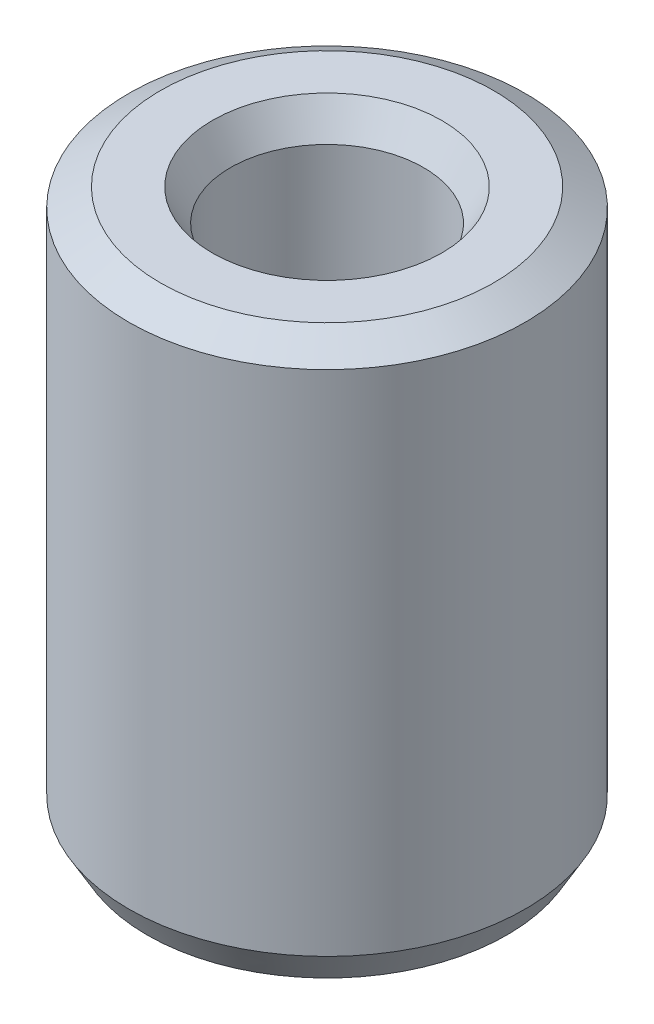
ISO-10303-21;
HEADER;
FILE_DESCRIPTION(('STEP AP214'),'2;1');
FILE_NAME('part.step','',(''),(''),'','','');
FILE_SCHEMA(('AUTOMOTIVE_DESIGN { 1 0 10303 214 1 1 1 1 }'));
ENDSEC;
DATA;
#1=APPLICATION_CONTEXT('core data for automotive mechanical design processes');
#2=APPLICATION_PROTOCOL_DEFINITION('international standard','automotive_design',2000,#1);
#3=PRODUCT_CONTEXT('',#1,'mechanical');
#4=PRODUCT('Part','Part','',(#3));
#5=PRODUCT_RELATED_PRODUCT_CATEGORY('part','',(#4));
#6=PRODUCT_DEFINITION_FORMATION('','',#4);
#7=PRODUCT_DEFINITION_CONTEXT('part definition',#1,'design');
#8=PRODUCT_DEFINITION('design','',#6,#7);
#9=PRODUCT_DEFINITION_SHAPE('','',#8);
#10=(LENGTH_UNIT() NAMED_UNIT(*) SI_UNIT(.MILLI.,.METRE.));
#11=(NAMED_UNIT(*) PLANE_ANGLE_UNIT() SI_UNIT($,.RADIAN.));
#12=(NAMED_UNIT(*) SI_UNIT($,.STERADIAN.) SOLID_ANGLE_UNIT());
#13=UNCERTAINTY_MEASURE_WITH_UNIT(LENGTH_MEASURE(1.E-05),#10,'distance_accuracy_value','');
#14=(GEOMETRIC_REPRESENTATION_CONTEXT(3) GLOBAL_UNCERTAINTY_ASSIGNED_CONTEXT((#13)) GLOBAL_UNIT_ASSIGNED_CONTEXT((#10,
#11,#12)) REPRESENTATION_CONTEXT('',''));
#15=CARTESIAN_POINT('',(0.,0.,0.));
#16=DIRECTION('',(0.,0.,1.));
#17=DIRECTION('',(1.,0.,0.));
#18=AXIS2_PLACEMENT_3D('',#15,#16,#17);
#19=CARTESIAN_POINT('',(0.,105.562151461287,0.));
#20=DIRECTION('',(0.,-1.,0.));
#21=DIRECTION('',(0.,0.,-1.));
#22=AXIS2_PLACEMENT_3D('',#19,#20,#21);
#23=CYLINDRICAL_SURFACE('',#22,37.5);
#24=CARTESIAN_POINT('',(0.,5.980593643517,0.));
#25=DIRECTION('',(0.,1.,0.));
#26=DIRECTION('',(0.,0.,1.));
#27=AXIS2_PLACEMENT_3D('',#24,#25,#26);
#28=CIRCLE('',#27,37.5);
#29=CARTESIAN_POINT('',(0.,5.980593643517,37.5));
#30=VERTEX_POINT('',#29);
#31=EDGE_CURVE('E10',#30,#30,#28,.T.);
#32=ORIENTED_EDGE('',*,*,#31,.T.);
#33=EDGE_LOOP('',(#32));
#34=FACE_BOUND('',#33,.T.);
#35=CARTESIAN_POINT('',(0.,102.109254111288,0.));
#36=DIRECTION('',(0.,1.,0.));
#37=DIRECTION('',(0.,0.,1.));
#38=AXIS2_PLACEMENT_3D('',#35,#36,#37);
#39=CIRCLE('',#38,37.5);
#40=CARTESIAN_POINT('',(0.,102.109254111288,37.5));
#41=VERTEX_POINT('',#40);
#42=EDGE_CURVE('E50',#41,#41,#39,.F.);
#43=ORIENTED_EDGE('',*,*,#42,.T.);
#44=EDGE_LOOP('',(#43));
#45=FACE_BOUND('',#44,.T.);
#46=ADVANCED_FACE('F39',(#34,#45),#23,.T.);
#47=CARTESIAN_POINT('',(0.,105.562151461287,0.));
#48=DIRECTION('',(0.,1.,0.));
#49=DIRECTION('',(0.,0.,1.));
#50=AXIS2_PLACEMENT_3D('',#47,#48,#49);
#51=PLANE('',#50);
#52=CARTESIAN_POINT('',(0.,105.562151461287,0.));
#53=DIRECTION('',(0.,1.,0.));
#54=DIRECTION('',(0.,0.,1.));
#55=AXIS2_PLACEMENT_3D('',#52,#53,#54);
#56=CIRCLE('',#55,21.7124673029602);
#57=CARTESIAN_POINT('',(0.,105.562151461287,21.7124673029602));
#58=VERTEX_POINT('',#57);
#59=EDGE_CURVE('E58',#58,#58,#56,.F.);
#60=ORIENTED_EDGE('',*,*,#59,.T.);
#61=EDGE_LOOP('',(#60));
#62=FACE_BOUND('',#61,.T.);
#63=CARTESIAN_POINT('',(0.,105.562151461287,0.));
#64=DIRECTION('',(0.,1.,0.));
#65=DIRECTION('',(0.,0.,1.));
#66=AXIS2_PLACEMENT_3D('',#63,#64,#65);
#67=CIRCLE('',#66,31.5194063564831);
#68=CARTESIAN_POINT('',(0.,105.562151461287,31.5194063564831));
#69=VERTEX_POINT('',#68);
#70=EDGE_CURVE('E61',#69,#69,#67,.T.);
#71=ORIENTED_EDGE('',*,*,#70,.T.);
#72=EDGE_LOOP('',(#71));
#73=FACE_BOUND('',#72,.T.);
#74=ADVANCED_FACE('F88',(#62,#73),#51,.T.);
#75=CARTESIAN_POINT('',(0.,0.,0.));
#76=DIRECTION('',(0.,1.,0.));
#77=DIRECTION('',(0.,0.,1.));
#78=AXIS2_PLACEMENT_3D('',#75,#76,#77);
#79=PLANE('',#78);
#80=CARTESIAN_POINT('',(0.,0.,0.));
#81=DIRECTION('',(0.,1.,0.));
#82=DIRECTION('',(0.,0.,1.));
#83=AXIS2_PLACEMENT_3D('',#80,#81,#82);
#84=CIRCLE('',#83,24.2401635964789);
#85=CARTESIAN_POINT('',(0.,0.,24.2401635964789));
#86=VERTEX_POINT('',#85);
#87=EDGE_CURVE('E51',#86,#86,#84,.T.);
#88=ORIENTED_EDGE('',*,*,#87,.T.);
#89=EDGE_LOOP('',(#88));
#90=FACE_BOUND('',#89,.T.);
#91=CARTESIAN_POINT('',(0.,0.,0.));
#92=DIRECTION('',(0.,1.,0.));
#93=DIRECTION('',(0.,0.,1.));
#94=AXIS2_PLACEMENT_3D('',#91,#92,#93);
#95=CIRCLE('',#94,34.0471026500017);
#96=CARTESIAN_POINT('',(0.,0.,34.0471026500017));
#97=VERTEX_POINT('',#96);
#98=EDGE_CURVE('E54',#97,#97,#95,.F.);
#99=ORIENTED_EDGE('',*,*,#98,.T.);
#100=EDGE_LOOP('',(#99));
#101=FACE_BOUND('',#100,.T.);
#102=ADVANCED_FACE('F83',(#90,#101),#79,.F.);
#103=CARTESIAN_POINT('',(0.,105.562151461287,0.));
#104=DIRECTION('',(0.,-1.,0.));
#105=DIRECTION('',(0.,0.,-1.));
#106=AXIS2_PLACEMENT_3D('',#103,#104,#105);
#107=CYLINDRICAL_SURFACE('',#106,18.2595699529619);
#108=CARTESIAN_POINT('',(0.,99.5815578177695,0.));
#109=DIRECTION('',(0.,1.,0.));
#110=DIRECTION('',(0.,0.,1.));
#111=AXIS2_PLACEMENT_3D('',#108,#109,#110);
#112=CIRCLE('',#111,18.2595699529619);
#113=CARTESIAN_POINT('',(0.,99.5815578177695,18.2595699529619));
#114=VERTEX_POINT('',#113);
#115=EDGE_CURVE('E67',#114,#114,#112,.T.);
#116=ORIENTED_EDGE('',*,*,#115,.T.);
#117=EDGE_LOOP('',(#116));
#118=FACE_BOUND('',#117,.T.);
#119=CARTESIAN_POINT('',(0.,3.45289734999832,0.));
#120=DIRECTION('',(0.,1.,0.));
#121=DIRECTION('',(0.,0.,1.));
#122=AXIS2_PLACEMENT_3D('',#119,#120,#121);
#123=CIRCLE('',#122,18.2595699529619);
#124=CARTESIAN_POINT('',(0.,3.45289734999832,18.2595699529619));
#125=VERTEX_POINT('',#124);
#126=EDGE_CURVE('E69',#125,#125,#123,.F.);
#127=ORIENTED_EDGE('',*,*,#126,.T.);
#128=EDGE_LOOP('',(#127));
#129=FACE_BOUND('',#128,.T.);
#130=ADVANCED_FACE('F71',(#118,#129),#107,.F.);
#131=CARTESIAN_POINT('',(0.,99.5815578177695,0.));
#132=DIRECTION('',(0.,1.,0.));
#133=DIRECTION('',(0.,0.,1.));
#134=AXIS2_PLACEMENT_3D('',#131,#132,#133);
#135=CONICAL_SURFACE('',#134,18.2595699529619,0.523598775598304);
#136=ORIENTED_EDGE('',*,*,#59,.F.);
#137=EDGE_LOOP('',(#136));
#138=FACE_BOUND('',#137,.T.);
#139=ORIENTED_EDGE('',*,*,#115,.F.);
#140=EDGE_LOOP('',(#139));
#141=FACE_BOUND('',#140,.T.);
#142=ADVANCED_FACE('F77',(#138,#141),#135,.F.);
#143=CARTESIAN_POINT('',(0.,0.,0.));
#144=DIRECTION('',(0.,-1.,0.));
#145=DIRECTION('',(0.,0.,-1.));
#146=AXIS2_PLACEMENT_3D('',#143,#144,#145);
#147=CONICAL_SURFACE('',#146,24.2401635964789,1.0471975511966);
#148=ORIENTED_EDGE('',*,*,#126,.F.);
#149=EDGE_LOOP('',(#148));
#150=FACE_BOUND('',#149,.T.);
#151=ORIENTED_EDGE('',*,*,#87,.F.);
#152=EDGE_LOOP('',(#151));
#153=FACE_BOUND('',#152,.T.);
#154=ADVANCED_FACE('F73',(#150,#153),#147,.F.);
#155=CARTESIAN_POINT('',(0.,5.980593643517,0.));
#156=DIRECTION('',(0.,1.,0.));
#157=DIRECTION('',(0.,0.,1.));
#158=AXIS2_PLACEMENT_3D('',#155,#156,#157);
#159=CONICAL_SURFACE('',#158,37.5,0.523598775598303);
#160=ORIENTED_EDGE('',*,*,#98,.F.);
#161=EDGE_LOOP('',(#160));
#162=FACE_BOUND('',#161,.T.);
#163=ORIENTED_EDGE('',*,*,#31,.F.);
#164=EDGE_LOOP('',(#163));
#165=FACE_BOUND('',#164,.T.);
#166=ADVANCED_FACE('F76',(#162,#165),#159,.T.);
#167=CARTESIAN_POINT('',(0.,105.562151461287,0.));
#168=DIRECTION('',(0.,-1.,0.));
#169=DIRECTION('',(0.,0.,-1.));
#170=AXIS2_PLACEMENT_3D('',#167,#168,#169);
#171=CONICAL_SURFACE('',#170,31.5194063564831,1.04719755119659);
#172=ORIENTED_EDGE('',*,*,#42,.F.);
#173=EDGE_LOOP('',(#172));
#174=FACE_BOUND('',#173,.T.);
#175=ORIENTED_EDGE('',*,*,#70,.F.);
#176=EDGE_LOOP('',(#175));
#177=FACE_BOUND('',#176,.T.);
#178=ADVANCED_FACE('F45',(#174,#177),#171,.T.);
#179=CLOSED_SHELL('',(#46,#74,#102,#130,#142,#154,#166,#178));
#180=MANIFOLD_SOLID_BREP('B2',#179);
#181=ADVANCED_BREP_SHAPE_REPRESENTATION('',(#18,#180),#14);
#182=SHAPE_DEFINITION_REPRESENTATION(#9,#181);
ENDSEC;
END-ISO-10303-21;
